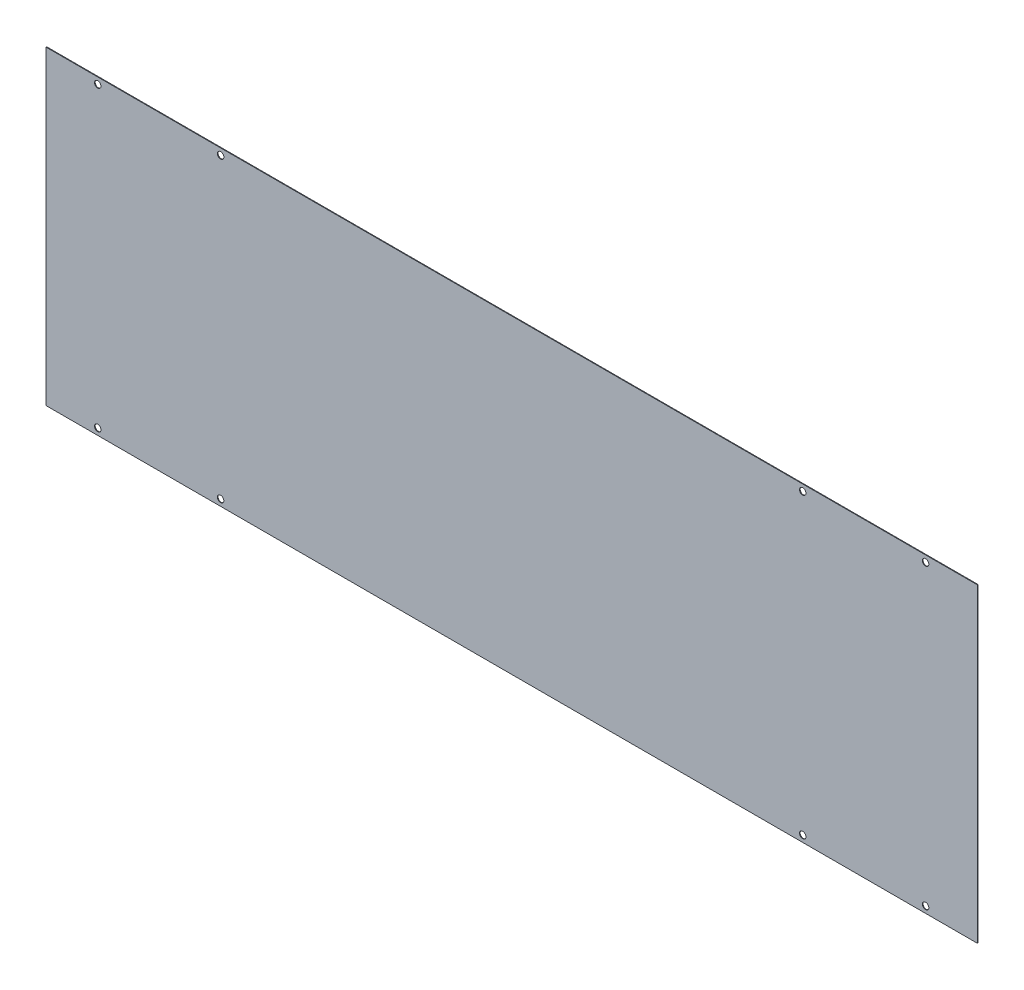
ISO-10303-21;
HEADER;
FILE_DESCRIPTION(('STEP AP214'),'2;1');
FILE_NAME('part.step','',(''),(''),'','','');
FILE_SCHEMA(('AUTOMOTIVE_DESIGN { 1 0 10303 214 1 1 1 1 }'));
ENDSEC;
DATA;
#1=APPLICATION_CONTEXT('core data for automotive mechanical design processes');
#2=APPLICATION_PROTOCOL_DEFINITION('international standard','automotive_design',2000,#1);
#3=PRODUCT_CONTEXT('',#1,'mechanical');
#4=PRODUCT('Part','Part','',(#3));
#5=PRODUCT_RELATED_PRODUCT_CATEGORY('part','',(#4));
#6=PRODUCT_DEFINITION_FORMATION('','',#4);
#7=PRODUCT_DEFINITION_CONTEXT('part definition',#1,'design');
#8=PRODUCT_DEFINITION('design','',#6,#7);
#9=PRODUCT_DEFINITION_SHAPE('','',#8);
#10=(LENGTH_UNIT() NAMED_UNIT(*) SI_UNIT(.MILLI.,.METRE.));
#11=(NAMED_UNIT(*) PLANE_ANGLE_UNIT() SI_UNIT($,.RADIAN.));
#12=(NAMED_UNIT(*) SI_UNIT($,.STERADIAN.) SOLID_ANGLE_UNIT());
#13=UNCERTAINTY_MEASURE_WITH_UNIT(LENGTH_MEASURE(1.E-05),#10,'distance_accuracy_value','');
#14=(GEOMETRIC_REPRESENTATION_CONTEXT(3) GLOBAL_UNCERTAINTY_ASSIGNED_CONTEXT((#13)) GLOBAL_UNIT_ASSIGNED_CONTEXT((#10,
#11,#12)) REPRESENTATION_CONTEXT('',''));
#15=CARTESIAN_POINT('',(0.,0.,0.));
#16=DIRECTION('',(0.,0.,1.));
#17=DIRECTION('',(1.,0.,0.));
#18=AXIS2_PLACEMENT_3D('',#15,#16,#17);
#19=CARTESIAN_POINT('',(0.,0.,0.635));
#20=DIRECTION('',(0.,0.,-1.));
#21=DIRECTION('',(-1.,0.,0.));
#22=AXIS2_PLACEMENT_3D('',#19,#20,#21);
#23=PLANE('',#22);
#24=CARTESIAN_POINT('',(-406.4,146.05,0.635000000000001));
#25=DIRECTION('',(0.,0.,1.));
#26=DIRECTION('',(1.,0.,0.));
#27=AXIS2_PLACEMENT_3D('',#24,#25,#26);
#28=CIRCLE('',#27,3.17499999999998);
#29=CARTESIAN_POINT('',(-403.225,146.05,0.635000000000001));
#30=VERTEX_POINT('',#29);
#31=EDGE_CURVE('E151',#30,#30,#28,.T.);
#32=ORIENTED_EDGE('',*,*,#31,.F.);
#33=EDGE_LOOP('',(#32));
#34=FACE_BOUND('',#33,.T.);
#35=CARTESIAN_POINT('',(-406.4,-146.05,0.635000000000001));
#36=DIRECTION('',(0.,0.,1.));
#37=DIRECTION('',(1.,0.,0.));
#38=AXIS2_PLACEMENT_3D('',#35,#36,#37);
#39=CIRCLE('',#38,3.17499999999998);
#40=CARTESIAN_POINT('',(-403.225,-146.05,0.635000000000001));
#41=VERTEX_POINT('',#40);
#42=EDGE_CURVE('E145',#41,#41,#39,.T.);
#43=ORIENTED_EDGE('',*,*,#42,.F.);
#44=EDGE_LOOP('',(#43));
#45=FACE_BOUND('',#44,.T.);
#46=CARTESIAN_POINT('',(-285.75,-146.05,0.635000000000001));
#47=DIRECTION('',(0.,0.,1.));
#48=DIRECTION('',(1.,0.,0.));
#49=AXIS2_PLACEMENT_3D('',#46,#47,#48);
#50=CIRCLE('',#49,3.17499999999998);
#51=CARTESIAN_POINT('',(-282.575,-146.05,0.635000000000001));
#52=VERTEX_POINT('',#51);
#53=EDGE_CURVE('E139',#52,#52,#50,.T.);
#54=ORIENTED_EDGE('',*,*,#53,.F.);
#55=EDGE_LOOP('',(#54));
#56=FACE_BOUND('',#55,.T.);
#57=CARTESIAN_POINT('',(285.75,146.05,0.635000000000001));
#58=DIRECTION('',(0.,0.,1.));
#59=DIRECTION('',(1.,0.,0.));
#60=AXIS2_PLACEMENT_3D('',#57,#58,#59);
#61=CIRCLE('',#60,3.17499999999998);
#62=CARTESIAN_POINT('',(288.925,146.05,0.635000000000001));
#63=VERTEX_POINT('',#62);
#64=EDGE_CURVE('E133',#63,#63,#61,.T.);
#65=ORIENTED_EDGE('',*,*,#64,.F.);
#66=EDGE_LOOP('',(#65));
#67=FACE_BOUND('',#66,.T.);
#68=CARTESIAN_POINT('',(406.4,146.05,0.635000000000001));
#69=DIRECTION('',(0.,0.,1.));
#70=DIRECTION('',(1.,0.,0.));
#71=AXIS2_PLACEMENT_3D('',#68,#69,#70);
#72=CIRCLE('',#71,3.17499999999998);
#73=CARTESIAN_POINT('',(409.575,146.05,0.635000000000001));
#74=VERTEX_POINT('',#73);
#75=EDGE_CURVE('E127',#74,#74,#72,.T.);
#76=ORIENTED_EDGE('',*,*,#75,.F.);
#77=EDGE_LOOP('',(#76));
#78=FACE_BOUND('',#77,.T.);
#79=CARTESIAN_POINT('',(406.4,-146.05,0.635000000000001));
#80=DIRECTION('',(0.,0.,1.));
#81=DIRECTION('',(1.,0.,0.));
#82=AXIS2_PLACEMENT_3D('',#79,#80,#81);
#83=CIRCLE('',#82,3.17499999999998);
#84=CARTESIAN_POINT('',(409.575,-146.05,0.635000000000001));
#85=VERTEX_POINT('',#84);
#86=EDGE_CURVE('E121',#85,#85,#83,.T.);
#87=ORIENTED_EDGE('',*,*,#86,.F.);
#88=EDGE_LOOP('',(#87));
#89=FACE_BOUND('',#88,.T.);
#90=CARTESIAN_POINT('',(285.75,-146.05,0.635000000000001));
#91=DIRECTION('',(0.,0.,1.));
#92=DIRECTION('',(1.,0.,0.));
#93=AXIS2_PLACEMENT_3D('',#90,#91,#92);
#94=CIRCLE('',#93,3.17499999999998);
#95=CARTESIAN_POINT('',(288.925,-146.05,0.635000000000001));
#96=VERTEX_POINT('',#95);
#97=EDGE_CURVE('E115',#96,#96,#94,.T.);
#98=ORIENTED_EDGE('',*,*,#97,.F.);
#99=EDGE_LOOP('',(#98));
#100=FACE_BOUND('',#99,.T.);
#101=DIRECTION('',(0.,1.,0.));
#102=VECTOR('',#101,1.);
#103=CARTESIAN_POINT('',(457.2,-152.4,0.635));
#104=LINE('',#103,#102);
#105=CARTESIAN_POINT('',(457.2,-152.4,0.635));
#106=VERTEX_POINT('',#105);
#107=CARTESIAN_POINT('',(457.2,152.4,0.635));
#108=VERTEX_POINT('',#107);
#109=EDGE_CURVE('E86',#106,#108,#104,.T.);
#110=ORIENTED_EDGE('',*,*,#109,.T.);
#111=DIRECTION('',(-1.,0.,0.));
#112=VECTOR('',#111,1.);
#113=CARTESIAN_POINT('',(-457.2,152.4,0.635));
#114=LINE('',#113,#112);
#115=CARTESIAN_POINT('',(-457.2,152.4,0.635));
#116=VERTEX_POINT('',#115);
#117=EDGE_CURVE('E81',#108,#116,#114,.T.);
#118=ORIENTED_EDGE('',*,*,#117,.T.);
#119=DIRECTION('',(0.,-1.,0.));
#120=VECTOR('',#119,1.);
#121=CARTESIAN_POINT('',(-457.2,-152.4,0.635));
#122=LINE('',#121,#120);
#123=CARTESIAN_POINT('',(-457.2,-152.4,0.635));
#124=VERTEX_POINT('',#123);
#125=EDGE_CURVE('E84',#116,#124,#122,.T.);
#126=ORIENTED_EDGE('',*,*,#125,.T.);
#127=DIRECTION('',(1.,0.,0.));
#128=VECTOR('',#127,1.);
#129=CARTESIAN_POINT('',(-457.2,-152.4,0.635));
#130=LINE('',#129,#128);
#131=EDGE_CURVE('E51',#124,#106,#130,.T.);
#132=ORIENTED_EDGE('',*,*,#131,.T.);
#133=EDGE_LOOP('',(#110,#118,#126,#132));
#134=FACE_BOUND('',#133,.T.);
#135=CARTESIAN_POINT('',(-285.75,146.05,0.635000000000001));
#136=DIRECTION('',(0.,0.,1.));
#137=DIRECTION('',(1.,0.,0.));
#138=AXIS2_PLACEMENT_3D('',#135,#136,#137);
#139=CIRCLE('',#138,3.17499999999998);
#140=CARTESIAN_POINT('',(-282.575,146.05,0.635000000000001));
#141=VERTEX_POINT('',#140);
#142=EDGE_CURVE('E157',#141,#141,#139,.T.);
#143=ORIENTED_EDGE('',*,*,#142,.F.);
#144=EDGE_LOOP('',(#143));
#145=FACE_BOUND('',#144,.T.);
#146=ADVANCED_FACE('F34',(#34,#45,#56,#67,#78,#89,#100,#134,#145),#23,.F.);
#147=CARTESIAN_POINT('',(0.,0.,0.));
#148=DIRECTION('',(0.,0.,-1.));
#149=DIRECTION('',(-1.,0.,0.));
#150=AXIS2_PLACEMENT_3D('',#147,#148,#149);
#151=PLANE('',#150);
#152=CARTESIAN_POINT('',(-285.75,146.05,0.));
#153=DIRECTION('',(0.,0.,1.));
#154=DIRECTION('',(1.,0.,0.));
#155=AXIS2_PLACEMENT_3D('',#152,#153,#154);
#156=CIRCLE('',#155,3.17499999999998);
#157=CARTESIAN_POINT('',(-282.575,146.05,0.));
#158=VERTEX_POINT('',#157);
#159=EDGE_CURVE('E154',#158,#158,#156,.T.);
#160=ORIENTED_EDGE('',*,*,#159,.T.);
#161=EDGE_LOOP('',(#160));
#162=FACE_BOUND('',#161,.T.);
#163=DIRECTION('',(0.,1.,0.));
#164=VECTOR('',#163,1.);
#165=CARTESIAN_POINT('',(457.2,-152.4,0.));
#166=LINE('',#165,#164);
#167=CARTESIAN_POINT('',(457.2,-152.4,0.));
#168=VERTEX_POINT('',#167);
#169=CARTESIAN_POINT('',(457.2,152.4,0.));
#170=VERTEX_POINT('',#169);
#171=EDGE_CURVE('E98',#168,#170,#166,.T.);
#172=ORIENTED_EDGE('',*,*,#171,.F.);
#173=DIRECTION('',(1.,0.,0.));
#174=VECTOR('',#173,1.);
#175=CARTESIAN_POINT('',(-457.2,-152.4,0.));
#176=LINE('',#175,#174);
#177=CARTESIAN_POINT('',(-457.2,-152.4,0.));
#178=VERTEX_POINT('',#177);
#179=EDGE_CURVE('E74',#178,#168,#176,.T.);
#180=ORIENTED_EDGE('',*,*,#179,.F.);
#181=DIRECTION('',(0.,-1.,0.));
#182=VECTOR('',#181,1.);
#183=CARTESIAN_POINT('',(-457.2,-152.4,0.));
#184=LINE('',#183,#182);
#185=CARTESIAN_POINT('',(-457.2,152.4,0.));
#186=VERTEX_POINT('',#185);
#187=EDGE_CURVE('E68',#186,#178,#184,.T.);
#188=ORIENTED_EDGE('',*,*,#187,.F.);
#189=DIRECTION('',(-1.,0.,0.));
#190=VECTOR('',#189,1.);
#191=CARTESIAN_POINT('',(-457.2,152.4,0.));
#192=LINE('',#191,#190);
#193=EDGE_CURVE('E90',#170,#186,#192,.T.);
#194=ORIENTED_EDGE('',*,*,#193,.F.);
#195=EDGE_LOOP('',(#172,#180,#188,#194));
#196=FACE_BOUND('',#195,.T.);
#197=CARTESIAN_POINT('',(285.75,-146.05,0.));
#198=DIRECTION('',(0.,0.,1.));
#199=DIRECTION('',(1.,0.,0.));
#200=AXIS2_PLACEMENT_3D('',#197,#198,#199);
#201=CIRCLE('',#200,3.17499999999998);
#202=CARTESIAN_POINT('',(288.925,-146.05,0.));
#203=VERTEX_POINT('',#202);
#204=EDGE_CURVE('E101',#203,#203,#201,.T.);
#205=ORIENTED_EDGE('',*,*,#204,.T.);
#206=EDGE_LOOP('',(#205));
#207=FACE_BOUND('',#206,.T.);
#208=CARTESIAN_POINT('',(406.4,-146.05,0.));
#209=DIRECTION('',(0.,0.,1.));
#210=DIRECTION('',(1.,0.,0.));
#211=AXIS2_PLACEMENT_3D('',#208,#209,#210);
#212=CIRCLE('',#211,3.17499999999998);
#213=CARTESIAN_POINT('',(409.575,-146.05,0.));
#214=VERTEX_POINT('',#213);
#215=EDGE_CURVE('E118',#214,#214,#212,.T.);
#216=ORIENTED_EDGE('',*,*,#215,.T.);
#217=EDGE_LOOP('',(#216));
#218=FACE_BOUND('',#217,.T.);
#219=CARTESIAN_POINT('',(406.4,146.05,0.));
#220=DIRECTION('',(0.,0.,1.));
#221=DIRECTION('',(1.,0.,0.));
#222=AXIS2_PLACEMENT_3D('',#219,#220,#221);
#223=CIRCLE('',#222,3.17499999999998);
#224=CARTESIAN_POINT('',(409.575,146.05,0.));
#225=VERTEX_POINT('',#224);
#226=EDGE_CURVE('E124',#225,#225,#223,.T.);
#227=ORIENTED_EDGE('',*,*,#226,.T.);
#228=EDGE_LOOP('',(#227));
#229=FACE_BOUND('',#228,.T.);
#230=CARTESIAN_POINT('',(285.75,146.05,0.));
#231=DIRECTION('',(0.,0.,1.));
#232=DIRECTION('',(1.,0.,0.));
#233=AXIS2_PLACEMENT_3D('',#230,#231,#232);
#234=CIRCLE('',#233,3.17499999999998);
#235=CARTESIAN_POINT('',(288.925,146.05,0.));
#236=VERTEX_POINT('',#235);
#237=EDGE_CURVE('E130',#236,#236,#234,.T.);
#238=ORIENTED_EDGE('',*,*,#237,.T.);
#239=EDGE_LOOP('',(#238));
#240=FACE_BOUND('',#239,.T.);
#241=CARTESIAN_POINT('',(-285.75,-146.05,0.));
#242=DIRECTION('',(0.,0.,1.));
#243=DIRECTION('',(1.,0.,0.));
#244=AXIS2_PLACEMENT_3D('',#241,#242,#243);
#245=CIRCLE('',#244,3.17499999999998);
#246=CARTESIAN_POINT('',(-282.575,-146.05,0.));
#247=VERTEX_POINT('',#246);
#248=EDGE_CURVE('E136',#247,#247,#245,.T.);
#249=ORIENTED_EDGE('',*,*,#248,.T.);
#250=EDGE_LOOP('',(#249));
#251=FACE_BOUND('',#250,.T.);
#252=CARTESIAN_POINT('',(-406.4,-146.05,0.));
#253=DIRECTION('',(0.,0.,1.));
#254=DIRECTION('',(1.,0.,0.));
#255=AXIS2_PLACEMENT_3D('',#252,#253,#254);
#256=CIRCLE('',#255,3.17499999999998);
#257=CARTESIAN_POINT('',(-403.225,-146.05,0.));
#258=VERTEX_POINT('',#257);
#259=EDGE_CURVE('E142',#258,#258,#256,.T.);
#260=ORIENTED_EDGE('',*,*,#259,.T.);
#261=EDGE_LOOP('',(#260));
#262=FACE_BOUND('',#261,.T.);
#263=CARTESIAN_POINT('',(-406.4,146.05,0.));
#264=DIRECTION('',(0.,0.,1.));
#265=DIRECTION('',(1.,0.,0.));
#266=AXIS2_PLACEMENT_3D('',#263,#264,#265);
#267=CIRCLE('',#266,3.17499999999998);
#268=CARTESIAN_POINT('',(-403.225,146.05,0.));
#269=VERTEX_POINT('',#268);
#270=EDGE_CURVE('E148',#269,#269,#267,.T.);
#271=ORIENTED_EDGE('',*,*,#270,.T.);
#272=EDGE_LOOP('',(#271));
#273=FACE_BOUND('',#272,.T.);
#274=ADVANCED_FACE('F109',(#162,#196,#207,#218,#229,#240,#251,#262,#273),#151,.T.);
#275=CARTESIAN_POINT('',(457.2,-152.4,0.635));
#276=DIRECTION('',(-1.,0.,0.));
#277=DIRECTION('',(0.,0.,1.));
#278=AXIS2_PLACEMENT_3D('',#275,#276,#277);
#279=PLANE('',#278);
#280=ORIENTED_EDGE('',*,*,#171,.T.);
#281=DIRECTION('',(0.,0.,-1.));
#282=VECTOR('',#281,1.);
#283=CARTESIAN_POINT('',(457.2,152.4,0.635));
#284=LINE('',#283,#282);
#285=EDGE_CURVE('E11',#108,#170,#284,.T.);
#286=ORIENTED_EDGE('',*,*,#285,.F.);
#287=ORIENTED_EDGE('',*,*,#109,.F.);
#288=DIRECTION('',(0.,0.,-1.));
#289=VECTOR('',#288,1.);
#290=CARTESIAN_POINT('',(457.2,-152.4,0.635));
#291=LINE('',#290,#289);
#292=EDGE_CURVE('E94',#106,#168,#291,.T.);
#293=ORIENTED_EDGE('',*,*,#292,.T.);
#294=EDGE_LOOP('',(#280,#286,#287,#293));
#295=FACE_BOUND('',#294,.T.);
#296=ADVANCED_FACE('F36',(#295),#279,.F.);
#297=CARTESIAN_POINT('',(-457.2,152.4,0.635));
#298=DIRECTION('',(0.,-1.,0.));
#299=DIRECTION('',(0.,0.,-1.));
#300=AXIS2_PLACEMENT_3D('',#297,#298,#299);
#301=PLANE('',#300);
#302=ORIENTED_EDGE('',*,*,#193,.T.);
#303=DIRECTION('',(0.,0.,-1.));
#304=VECTOR('',#303,1.);
#305=CARTESIAN_POINT('',(-457.2,152.4,0.635));
#306=LINE('',#305,#304);
#307=EDGE_CURVE('E43',#116,#186,#306,.T.);
#308=ORIENTED_EDGE('',*,*,#307,.F.);
#309=ORIENTED_EDGE('',*,*,#117,.F.);
#310=ORIENTED_EDGE('',*,*,#285,.T.);
#311=EDGE_LOOP('',(#302,#308,#309,#310));
#312=FACE_BOUND('',#311,.T.);
#313=ADVANCED_FACE('F89',(#312),#301,.F.);
#314=CARTESIAN_POINT('',(-457.2,-152.4,0.635));
#315=DIRECTION('',(1.,0.,0.));
#316=DIRECTION('',(0.,0.,-1.));
#317=AXIS2_PLACEMENT_3D('',#314,#315,#316);
#318=PLANE('',#317);
#319=ORIENTED_EDGE('',*,*,#187,.T.);
#320=DIRECTION('',(0.,0.,-1.));
#321=VECTOR('',#320,1.);
#322=CARTESIAN_POINT('',(-457.2,-152.4,0.635));
#323=LINE('',#322,#321);
#324=EDGE_CURVE('E91',#124,#178,#323,.T.);
#325=ORIENTED_EDGE('',*,*,#324,.F.);
#326=ORIENTED_EDGE('',*,*,#125,.F.);
#327=ORIENTED_EDGE('',*,*,#307,.T.);
#328=EDGE_LOOP('',(#319,#325,#326,#327));
#329=FACE_BOUND('',#328,.T.);
#330=ADVANCED_FACE('F92',(#329),#318,.F.);
#331=CARTESIAN_POINT('',(-457.2,-152.4,0.635));
#332=DIRECTION('',(0.,1.,0.));
#333=DIRECTION('',(0.,0.,1.));
#334=AXIS2_PLACEMENT_3D('',#331,#332,#333);
#335=PLANE('',#334);
#336=ORIENTED_EDGE('',*,*,#179,.T.);
#337=ORIENTED_EDGE('',*,*,#292,.F.);
#338=ORIENTED_EDGE('',*,*,#131,.F.);
#339=ORIENTED_EDGE('',*,*,#324,.T.);
#340=EDGE_LOOP('',(#336,#337,#338,#339));
#341=FACE_BOUND('',#340,.T.);
#342=ADVANCED_FACE('F106',(#341),#335,.F.);
#343=CARTESIAN_POINT('',(285.75,-146.05,0.635));
#344=DIRECTION('',(0.,0.,1.));
#345=DIRECTION('',(1.,0.,0.));
#346=AXIS2_PLACEMENT_3D('',#343,#344,#345);
#347=CYLINDRICAL_SURFACE('',#346,3.17499999999998);
#348=ORIENTED_EDGE('',*,*,#204,.F.);
#349=EDGE_LOOP('',(#348));
#350=FACE_BOUND('',#349,.T.);
#351=ORIENTED_EDGE('',*,*,#97,.T.);
#352=EDGE_LOOP('',(#351));
#353=FACE_BOUND('',#352,.T.);
#354=ADVANCED_FACE('F173',(#350,#353),#347,.F.);
#355=CARTESIAN_POINT('',(406.4,-146.05,0.635));
#356=DIRECTION('',(0.,0.,1.));
#357=DIRECTION('',(1.,0.,0.));
#358=AXIS2_PLACEMENT_3D('',#355,#356,#357);
#359=CYLINDRICAL_SURFACE('',#358,3.17499999999998);
#360=ORIENTED_EDGE('',*,*,#215,.F.);
#361=EDGE_LOOP('',(#360));
#362=FACE_BOUND('',#361,.T.);
#363=ORIENTED_EDGE('',*,*,#86,.T.);
#364=EDGE_LOOP('',(#363));
#365=FACE_BOUND('',#364,.T.);
#366=ADVANCED_FACE('F244',(#362,#365),#359,.F.);
#367=CARTESIAN_POINT('',(406.4,146.05,0.635));
#368=DIRECTION('',(0.,0.,1.));
#369=DIRECTION('',(1.,0.,0.));
#370=AXIS2_PLACEMENT_3D('',#367,#368,#369);
#371=CYLINDRICAL_SURFACE('',#370,3.17499999999998);
#372=ORIENTED_EDGE('',*,*,#226,.F.);
#373=EDGE_LOOP('',(#372));
#374=FACE_BOUND('',#373,.T.);
#375=ORIENTED_EDGE('',*,*,#75,.T.);
#376=EDGE_LOOP('',(#375));
#377=FACE_BOUND('',#376,.T.);
#378=ADVANCED_FACE('F241',(#374,#377),#371,.F.);
#379=CARTESIAN_POINT('',(285.75,146.05,0.635));
#380=DIRECTION('',(0.,0.,1.));
#381=DIRECTION('',(1.,0.,0.));
#382=AXIS2_PLACEMENT_3D('',#379,#380,#381);
#383=CYLINDRICAL_SURFACE('',#382,3.17499999999998);
#384=ORIENTED_EDGE('',*,*,#237,.F.);
#385=EDGE_LOOP('',(#384));
#386=FACE_BOUND('',#385,.T.);
#387=ORIENTED_EDGE('',*,*,#64,.T.);
#388=EDGE_LOOP('',(#387));
#389=FACE_BOUND('',#388,.T.);
#390=ADVANCED_FACE('F204',(#386,#389),#383,.F.);
#391=CARTESIAN_POINT('',(-285.75,-146.05,0.635));
#392=DIRECTION('',(0.,0.,1.));
#393=DIRECTION('',(1.,0.,0.));
#394=AXIS2_PLACEMENT_3D('',#391,#392,#393);
#395=CYLINDRICAL_SURFACE('',#394,3.17499999999998);
#396=ORIENTED_EDGE('',*,*,#248,.F.);
#397=EDGE_LOOP('',(#396));
#398=FACE_BOUND('',#397,.T.);
#399=ORIENTED_EDGE('',*,*,#53,.T.);
#400=EDGE_LOOP('',(#399));
#401=FACE_BOUND('',#400,.T.);
#402=ADVANCED_FACE('F198',(#398,#401),#395,.F.);
#403=CARTESIAN_POINT('',(-406.4,-146.05,0.635));
#404=DIRECTION('',(0.,0.,1.));
#405=DIRECTION('',(1.,0.,0.));
#406=AXIS2_PLACEMENT_3D('',#403,#404,#405);
#407=CYLINDRICAL_SURFACE('',#406,3.17499999999998);
#408=ORIENTED_EDGE('',*,*,#259,.F.);
#409=EDGE_LOOP('',(#408));
#410=FACE_BOUND('',#409,.T.);
#411=ORIENTED_EDGE('',*,*,#42,.T.);
#412=EDGE_LOOP('',(#411));
#413=FACE_BOUND('',#412,.T.);
#414=ADVANCED_FACE('F203',(#410,#413),#407,.F.);
#415=CARTESIAN_POINT('',(-406.4,146.05,0.635));
#416=DIRECTION('',(0.,0.,1.));
#417=DIRECTION('',(1.,0.,0.));
#418=AXIS2_PLACEMENT_3D('',#415,#416,#417);
#419=CYLINDRICAL_SURFACE('',#418,3.17499999999998);
#420=ORIENTED_EDGE('',*,*,#270,.F.);
#421=EDGE_LOOP('',(#420));
#422=FACE_BOUND('',#421,.T.);
#423=ORIENTED_EDGE('',*,*,#31,.T.);
#424=EDGE_LOOP('',(#423));
#425=FACE_BOUND('',#424,.T.);
#426=ADVANCED_FACE('F215',(#422,#425),#419,.F.);
#427=CARTESIAN_POINT('',(-285.75,146.05,0.635));
#428=DIRECTION('',(0.,0.,1.));
#429=DIRECTION('',(1.,0.,0.));
#430=AXIS2_PLACEMENT_3D('',#427,#428,#429);
#431=CYLINDRICAL_SURFACE('',#430,3.17499999999998);
#432=ORIENTED_EDGE('',*,*,#159,.F.);
#433=EDGE_LOOP('',(#432));
#434=FACE_BOUND('',#433,.T.);
#435=ORIENTED_EDGE('',*,*,#142,.T.);
#436=EDGE_LOOP('',(#435));
#437=FACE_BOUND('',#436,.T.);
#438=ADVANCED_FACE('F161',(#434,#437),#431,.F.);
#439=CLOSED_SHELL('',(#146,#274,#296,#313,#330,#342,#354,#366,#378,#390,#402,#414,#426,#438));
#440=MANIFOLD_SOLID_BREP('B2',#439);
#441=ADVANCED_BREP_SHAPE_REPRESENTATION('',(#18,#440),#14);
#442=SHAPE_DEFINITION_REPRESENTATION(#9,#441);
ENDSEC;
END-ISO-10303-21;
